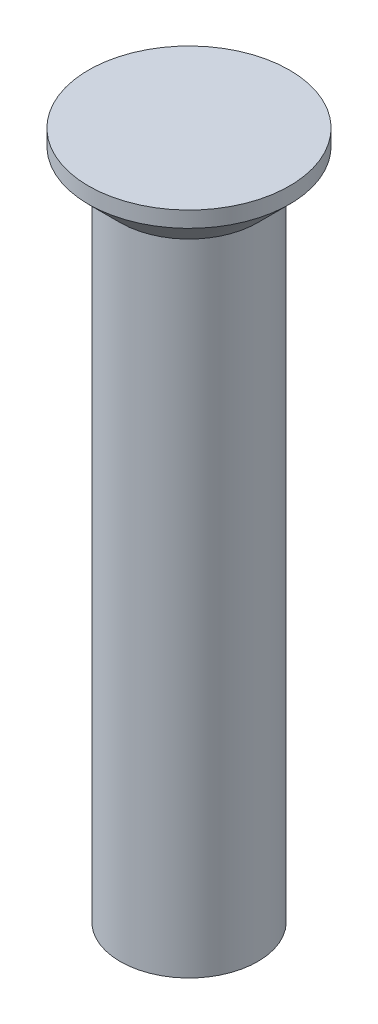
ISO-10303-21;
HEADER;
FILE_DESCRIPTION(('STEP AP214'),'2;1');
FILE_NAME('part.step','',(''),(''),'','','');
FILE_SCHEMA(('AUTOMOTIVE_DESIGN { 1 0 10303 214 1 1 1 1 }'));
ENDSEC;
DATA;
#1=APPLICATION_CONTEXT('core data for automotive mechanical design processes');
#2=APPLICATION_PROTOCOL_DEFINITION('international standard','automotive_design',2000,#1);
#3=PRODUCT_CONTEXT('',#1,'mechanical');
#4=PRODUCT('Part','Part','',(#3));
#5=PRODUCT_RELATED_PRODUCT_CATEGORY('part','',(#4));
#6=PRODUCT_DEFINITION_FORMATION('','',#4);
#7=PRODUCT_DEFINITION_CONTEXT('part definition',#1,'design');
#8=PRODUCT_DEFINITION('design','',#6,#7);
#9=PRODUCT_DEFINITION_SHAPE('','',#8);
#10=(LENGTH_UNIT() NAMED_UNIT(*) SI_UNIT(.MILLI.,.METRE.));
#11=(NAMED_UNIT(*) PLANE_ANGLE_UNIT() SI_UNIT($,.RADIAN.));
#12=(NAMED_UNIT(*) SI_UNIT($,.STERADIAN.) SOLID_ANGLE_UNIT());
#13=UNCERTAINTY_MEASURE_WITH_UNIT(LENGTH_MEASURE(1.E-05),#10,'distance_accuracy_value','');
#14=(GEOMETRIC_REPRESENTATION_CONTEXT(3) GLOBAL_UNCERTAINTY_ASSIGNED_CONTEXT((#13)) GLOBAL_UNIT_ASSIGNED_CONTEXT((#10,
#11,#12)) REPRESENTATION_CONTEXT('',''));
#15=CARTESIAN_POINT('',(0.,0.,0.));
#16=DIRECTION('',(0.,0.,1.));
#17=DIRECTION('',(1.,0.,0.));
#18=AXIS2_PLACEMENT_3D('',#15,#16,#17);
#19=CARTESIAN_POINT('',(0.,1.2,1.9));
#20=DIRECTION('',(0.,-1.,0.));
#21=DIRECTION('',(0.,0.,-1.));
#22=AXIS2_PLACEMENT_3D('',#19,#20,#21);
#23=PLANE('',#22);
#24=CARTESIAN_POINT('',(0.,1.2,0.));
#25=DIRECTION('',(0.,-1.,0.));
#26=DIRECTION('',(0.,0.,-1.));
#27=AXIS2_PLACEMENT_3D('',#24,#25,#26);
#28=CIRCLE('',#27,1.9);
#29=CARTESIAN_POINT('',(0.,1.2,-1.9));
#30=VERTEX_POINT('',#29);
#31=EDGE_CURVE('E18',#30,#30,#28,.T.);
#32=ORIENTED_EDGE('',*,*,#31,.F.);
#33=EDGE_LOOP('',(#32));
#34=FACE_BOUND('',#33,.T.);
#35=ADVANCED_FACE('F15',(#34),#23,.F.);
#36=CARTESIAN_POINT('',(0.,-2.70852012929174,0.));
#37=DIRECTION('',(0.,-1.,0.));
#38=DIRECTION('',(0.,0.,-1.));
#39=AXIS2_PLACEMENT_3D('',#36,#37,#38);
#40=CYLINDRICAL_SURFACE('',#39,1.9);
#41=CARTESIAN_POINT('',(0.,0.900000000001455,0.));
#42=DIRECTION('',(0.,1.,0.));
#43=DIRECTION('',(0.,0.,1.));
#44=AXIS2_PLACEMENT_3D('',#41,#42,#43);
#45=CIRCLE('',#44,1.90000000003465);
#46=CARTESIAN_POINT('',(0.,0.900000000001455,1.90000000003465));
#47=VERTEX_POINT('',#46);
#48=EDGE_CURVE('E27',#47,#47,#45,.F.);
#49=ORIENTED_EDGE('',*,*,#48,.F.);
#50=EDGE_LOOP('',(#49));
#51=FACE_BOUND('',#50,.T.);
#52=ORIENTED_EDGE('',*,*,#31,.T.);
#53=EDGE_LOOP('',(#52));
#54=FACE_BOUND('',#53,.T.);
#55=ADVANCED_FACE('F35',(#51,#54),#40,.T.);
#56=CARTESIAN_POINT('',(0.,-11.8,0.));
#57=DIRECTION('',(0.,-1.,0.));
#58=DIRECTION('',(0.,0.,-1.));
#59=AXIS2_PLACEMENT_3D('',#56,#57,#58);
#60=PLANE('',#59);
#61=CARTESIAN_POINT('',(0.,-11.8,0.));
#62=DIRECTION('',(0.,1.,0.));
#63=DIRECTION('',(0.,0.,1.));
#64=AXIS2_PLACEMENT_3D('',#61,#62,#63);
#65=CIRCLE('',#64,1.3);
#66=CARTESIAN_POINT('',(0.,-11.8,1.3));
#67=VERTEX_POINT('',#66);
#68=EDGE_CURVE('E22',#67,#67,#65,.T.);
#69=ORIENTED_EDGE('',*,*,#68,.F.);
#70=EDGE_LOOP('',(#69));
#71=FACE_BOUND('',#70,.T.);
#72=ADVANCED_FACE('F42',(#71),#60,.T.);
#73=CARTESIAN_POINT('',(0.,0.900000000001455,0.));
#74=DIRECTION('',(0.,1.,0.));
#75=DIRECTION('',(0.,0.,1.));
#76=AXIS2_PLACEMENT_3D('',#73,#74,#75);
#77=CONICAL_SURFACE('',#76,1.90000000003465,0.785398163397448);
#78=ORIENTED_EDGE('',*,*,#48,.T.);
#79=EDGE_LOOP('',(#78));
#80=FACE_BOUND('',#79,.T.);
#81=CARTESIAN_POINT('',(0.,0.3,0.));
#82=DIRECTION('',(0.,1.,0.));
#83=DIRECTION('',(0.,0.,1.));
#84=AXIS2_PLACEMENT_3D('',#81,#82,#83);
#85=CIRCLE('',#84,1.3);
#86=CARTESIAN_POINT('',(0.,0.3,1.3));
#87=VERTEX_POINT('',#86);
#88=EDGE_CURVE('E10',#87,#87,#85,.F.);
#89=ORIENTED_EDGE('',*,*,#88,.F.);
#90=EDGE_LOOP('',(#89));
#91=FACE_BOUND('',#90,.T.);
#92=ADVANCED_FACE('F46',(#80,#91),#77,.T.);
#93=CARTESIAN_POINT('',(0.,-11.8,0.));
#94=DIRECTION('',(0.,1.,0.));
#95=DIRECTION('',(0.,0.,1.));
#96=AXIS2_PLACEMENT_3D('',#93,#94,#95);
#97=CYLINDRICAL_SURFACE('',#96,1.3);
#98=ORIENTED_EDGE('',*,*,#88,.T.);
#99=EDGE_LOOP('',(#98));
#100=FACE_BOUND('',#99,.T.);
#101=ORIENTED_EDGE('',*,*,#68,.T.);
#102=EDGE_LOOP('',(#101));
#103=FACE_BOUND('',#102,.T.);
#104=ADVANCED_FACE('F44',(#100,#103),#97,.T.);
#105=CLOSED_SHELL('',(#35,#55,#72,#92,#104));
#106=MANIFOLD_SOLID_BREP('B1',#105);
#107=ADVANCED_BREP_SHAPE_REPRESENTATION('',(#18,#106),#14);
#108=SHAPE_DEFINITION_REPRESENTATION(#9,#107);
ENDSEC;
END-ISO-10303-21;
